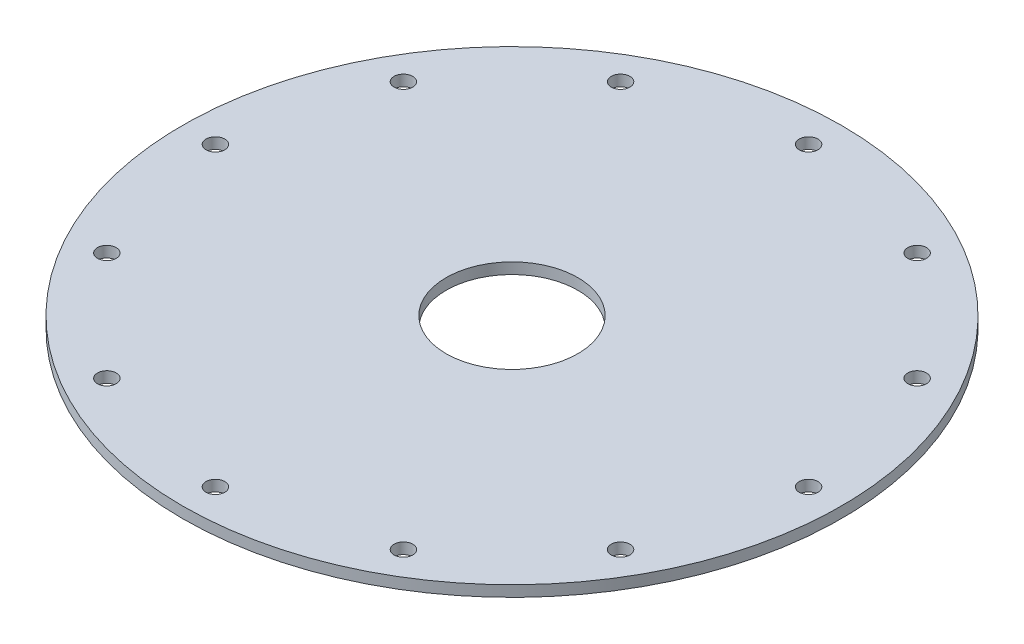
ISO-10303-21;
HEADER;
FILE_DESCRIPTION(('STEP AP214'),'2;1');
FILE_NAME('part.step','',(''),(''),'','','');
FILE_SCHEMA(('AUTOMOTIVE_DESIGN { 1 0 10303 214 1 1 1 1 }'));
ENDSEC;
DATA;
#1=APPLICATION_CONTEXT('core data for automotive mechanical design processes');
#2=APPLICATION_PROTOCOL_DEFINITION('international standard','automotive_design',2000,#1);
#3=PRODUCT_CONTEXT('',#1,'mechanical');
#4=PRODUCT('Part','Part','',(#3));
#5=PRODUCT_RELATED_PRODUCT_CATEGORY('part','',(#4));
#6=PRODUCT_DEFINITION_FORMATION('','',#4);
#7=PRODUCT_DEFINITION_CONTEXT('part definition',#1,'design');
#8=PRODUCT_DEFINITION('design','',#6,#7);
#9=PRODUCT_DEFINITION_SHAPE('','',#8);
#10=(LENGTH_UNIT() NAMED_UNIT(*) SI_UNIT(.MILLI.,.METRE.));
#11=(NAMED_UNIT(*) PLANE_ANGLE_UNIT() SI_UNIT($,.RADIAN.));
#12=(NAMED_UNIT(*) SI_UNIT($,.STERADIAN.) SOLID_ANGLE_UNIT());
#13=UNCERTAINTY_MEASURE_WITH_UNIT(LENGTH_MEASURE(1.E-05),#10,'distance_accuracy_value','');
#14=(GEOMETRIC_REPRESENTATION_CONTEXT(3) GLOBAL_UNCERTAINTY_ASSIGNED_CONTEXT((#13)) GLOBAL_UNIT_ASSIGNED_CONTEXT((#10,
#11,#12)) REPRESENTATION_CONTEXT('',''));
#15=CARTESIAN_POINT('',(0.,0.,0.));
#16=DIRECTION('',(0.,0.,1.));
#17=DIRECTION('',(1.,0.,0.));
#18=AXIS2_PLACEMENT_3D('',#15,#16,#17);
#19=CARTESIAN_POINT('',(-47.625,0.,0.));
#20=DIRECTION('',(0.,-1.,0.));
#21=DIRECTION('',(0.,0.,-1.));
#22=AXIS2_PLACEMENT_3D('',#19,#20,#21);
#23=PLANE('',#22);
#24=CARTESIAN_POINT('',(-21.4312500000004,0.,37.1200138697103));
#25=DIRECTION('',(0.,1.,0.));
#26=DIRECTION('',(0.,0.,1.));
#27=AXIS2_PLACEMENT_3D('',#24,#25,#26);
#28=CIRCLE('',#27,1.35255);
#29=CARTESIAN_POINT('',(-21.4312500000004,0.,38.4725638697103));
#30=VERTEX_POINT('',#29);
#31=EDGE_CURVE('E115',#30,#30,#28,.T.);
#32=ORIENTED_EDGE('',*,*,#31,.T.);
#33=EDGE_LOOP('',(#32));
#34=FACE_BOUND('',#33,.T.);
#35=CARTESIAN_POINT('',(21.4312499999997,0.,37.1200138697107));
#36=DIRECTION('',(0.,1.,0.));
#37=DIRECTION('',(0.,0.,1.));
#38=AXIS2_PLACEMENT_3D('',#35,#36,#37);
#39=CIRCLE('',#38,1.35255);
#40=CARTESIAN_POINT('',(21.4312499999997,0.,38.4725638697107));
#41=VERTEX_POINT('',#40);
#42=EDGE_CURVE('E103',#41,#41,#39,.T.);
#43=ORIENTED_EDGE('',*,*,#42,.T.);
#44=EDGE_LOOP('',(#43));
#45=FACE_BOUND('',#44,.T.);
#46=CARTESIAN_POINT('',(42.8625,0.,2.36953774157887E-13));
#47=DIRECTION('',(0.,1.,0.));
#48=DIRECTION('',(0.,0.,1.));
#49=AXIS2_PLACEMENT_3D('',#46,#47,#48);
#50=CIRCLE('',#49,1.35255);
#51=CARTESIAN_POINT('',(42.8625,0.,1.35255000000024));
#52=VERTEX_POINT('',#51);
#53=EDGE_CURVE('E91',#52,#52,#50,.T.);
#54=ORIENTED_EDGE('',*,*,#53,.T.);
#55=EDGE_LOOP('',(#54));
#56=FACE_BOUND('',#55,.T.);
#57=CARTESIAN_POINT('',(-21.4312499999999,0.,-37.1200138697105));
#58=DIRECTION('',(0.,1.,0.));
#59=DIRECTION('',(0.,0.,1.));
#60=AXIS2_PLACEMENT_3D('',#57,#58,#59);
#61=CIRCLE('',#60,1.35255);
#62=CARTESIAN_POINT('',(-21.4312499999999,0.,-35.7674638697105));
#63=VERTEX_POINT('',#62);
#64=EDGE_CURVE('E67',#63,#63,#61,.T.);
#65=ORIENTED_EDGE('',*,*,#64,.T.);
#66=EDGE_LOOP('',(#65));
#67=FACE_BOUND('',#66,.T.);
#68=CARTESIAN_POINT('',(-37.1200138697105,0.,-21.43125));
#69=DIRECTION('',(0.,1.,0.));
#70=DIRECTION('',(0.,0.,1.));
#71=AXIS2_PLACEMENT_3D('',#68,#69,#70);
#72=CIRCLE('',#71,1.35255);
#73=CARTESIAN_POINT('',(-37.1200138697105,0.,-20.0787));
#74=VERTEX_POINT('',#73);
#75=EDGE_CURVE('E61',#74,#74,#72,.T.);
#76=ORIENTED_EDGE('',*,*,#75,.T.);
#77=EDGE_LOOP('',(#76));
#78=FACE_BOUND('',#77,.T.);
#79=CARTESIAN_POINT('',(-42.8625,0.,0.));
#80=DIRECTION('',(0.,1.,0.));
#81=DIRECTION('',(0.,0.,1.));
#82=AXIS2_PLACEMENT_3D('',#79,#80,#81);
#83=CIRCLE('',#82,1.35255);
#84=CARTESIAN_POINT('',(-42.8625,0.,1.35255000000001));
#85=VERTEX_POINT('',#84);
#86=EDGE_CURVE('E55',#85,#85,#83,.T.);
#87=ORIENTED_EDGE('',*,*,#86,.T.);
#88=EDGE_LOOP('',(#87));
#89=FACE_BOUND('',#88,.T.);
#90=CARTESIAN_POINT('',(0.,0.,0.));
#91=DIRECTION('',(0.,1.,0.));
#92=DIRECTION('',(0.,0.,1.));
#93=AXIS2_PLACEMENT_3D('',#90,#91,#92);
#94=CIRCLE('',#93,9.525);
#95=CARTESIAN_POINT('',(0.,0.,9.525));
#96=VERTEX_POINT('',#95);
#97=EDGE_CURVE('E46',#96,#96,#94,.T.);
#98=ORIENTED_EDGE('',*,*,#97,.T.);
#99=EDGE_LOOP('',(#98));
#100=FACE_BOUND('',#99,.T.);
#101=CARTESIAN_POINT('',(0.,0.,0.));
#102=DIRECTION('',(0.,1.,0.));
#103=DIRECTION('',(0.,0.,1.));
#104=AXIS2_PLACEMENT_3D('',#101,#102,#103);
#105=CIRCLE('',#104,47.625);
#106=CARTESIAN_POINT('',(0.,0.,47.625));
#107=VERTEX_POINT('',#106);
#108=EDGE_CURVE('E50',#107,#107,#105,.T.);
#109=ORIENTED_EDGE('',*,*,#108,.F.);
#110=EDGE_LOOP('',(#109));
#111=FACE_BOUND('',#110,.T.);
#112=CARTESIAN_POINT('',(1.15852315907521E-13,0.,-42.8625));
#113=DIRECTION('',(0.,1.,0.));
#114=DIRECTION('',(0.,0.,1.));
#115=AXIS2_PLACEMENT_3D('',#112,#113,#114);
#116=CIRCLE('',#115,1.35255);
#117=CARTESIAN_POINT('',(1.15852315907521E-13,0.,-41.50995));
#118=VERTEX_POINT('',#117);
#119=EDGE_CURVE('E73',#118,#118,#116,.T.);
#120=ORIENTED_EDGE('',*,*,#119,.T.);
#121=EDGE_LOOP('',(#120));
#122=FACE_BOUND('',#121,.T.);
#123=CARTESIAN_POINT('',(21.4312500000001,0.,-37.1200138697104));
#124=DIRECTION('',(0.,1.,0.));
#125=DIRECTION('',(0.,0.,1.));
#126=AXIS2_PLACEMENT_3D('',#123,#124,#125);
#127=CIRCLE('',#126,1.35255);
#128=CARTESIAN_POINT('',(21.4312500000001,0.,-35.7674638697104));
#129=VERTEX_POINT('',#128);
#130=EDGE_CURVE('E79',#129,#129,#127,.T.);
#131=ORIENTED_EDGE('',*,*,#130,.T.);
#132=EDGE_LOOP('',(#131));
#133=FACE_BOUND('',#132,.T.);
#134=CARTESIAN_POINT('',(37.1200138697106,0.,-21.4312499999998));
#135=DIRECTION('',(0.,1.,0.));
#136=DIRECTION('',(0.,0.,1.));
#137=AXIS2_PLACEMENT_3D('',#134,#135,#136);
#138=CIRCLE('',#137,1.35255);
#139=CARTESIAN_POINT('',(37.1200138697106,0.,-20.0786999999998));
#140=VERTEX_POINT('',#139);
#141=EDGE_CURVE('E85',#140,#140,#138,.T.);
#142=ORIENTED_EDGE('',*,*,#141,.T.);
#143=EDGE_LOOP('',(#142));
#144=FACE_BOUND('',#143,.T.);
#145=CARTESIAN_POINT('',(37.1200138697104,0.,21.4312500000002));
#146=DIRECTION('',(0.,1.,0.));
#147=DIRECTION('',(0.,0.,1.));
#148=AXIS2_PLACEMENT_3D('',#145,#146,#147);
#149=CIRCLE('',#148,1.35255);
#150=CARTESIAN_POINT('',(37.1200138697104,0.,22.7838000000002));
#151=VERTEX_POINT('',#150);
#152=EDGE_CURVE('E97',#151,#151,#149,.T.);
#153=ORIENTED_EDGE('',*,*,#152,.T.);
#154=EDGE_LOOP('',(#153));
#155=FACE_BOUND('',#154,.T.);
#156=CARTESIAN_POINT('',(-3.67572619286853E-13,0.,42.8625));
#157=DIRECTION('',(0.,1.,0.));
#158=DIRECTION('',(0.,0.,1.));
#159=AXIS2_PLACEMENT_3D('',#156,#157,#158);
#160=CIRCLE('',#159,1.35255);
#161=CARTESIAN_POINT('',(-3.67572619286853E-13,0.,44.21505));
#162=VERTEX_POINT('',#161);
#163=EDGE_CURVE('E109',#162,#162,#160,.T.);
#164=ORIENTED_EDGE('',*,*,#163,.T.);
#165=EDGE_LOOP('',(#164));
#166=FACE_BOUND('',#165,.T.);
#167=CARTESIAN_POINT('',(-37.1200138697107,0.,21.4312499999996));
#168=DIRECTION('',(0.,1.,0.));
#169=DIRECTION('',(0.,0.,1.));
#170=AXIS2_PLACEMENT_3D('',#167,#168,#169);
#171=CIRCLE('',#170,1.35255);
#172=CARTESIAN_POINT('',(-37.1200138697107,0.,22.7837999999996));
#173=VERTEX_POINT('',#172);
#174=EDGE_CURVE('E121',#173,#173,#171,.T.);
#175=ORIENTED_EDGE('',*,*,#174,.T.);
#176=EDGE_LOOP('',(#175));
#177=FACE_BOUND('',#176,.T.);
#178=ADVANCED_FACE('F35',(#34,#45,#56,#67,#78,#89,#100,#111,#122,#133,#144,#155,#166,#177),#23,.T.);
#179=CARTESIAN_POINT('',(0.,55.,0.));
#180=DIRECTION('',(0.,1.,0.));
#181=DIRECTION('',(0.,0.,1.));
#182=AXIS2_PLACEMENT_3D('',#179,#180,#181);
#183=CYLINDRICAL_SURFACE('',#182,47.625);
#184=ORIENTED_EDGE('',*,*,#108,.T.);
#185=EDGE_LOOP('',(#184));
#186=FACE_BOUND('',#185,.T.);
#187=CARTESIAN_POINT('',(0.,1.5875,0.));
#188=DIRECTION('',(0.,1.,0.));
#189=DIRECTION('',(0.,0.,1.));
#190=AXIS2_PLACEMENT_3D('',#187,#188,#189);
#191=CIRCLE('',#190,47.625);
#192=CARTESIAN_POINT('',(0.,1.5875,47.625));
#193=VERTEX_POINT('',#192);
#194=EDGE_CURVE('E10',#193,#193,#191,.T.);
#195=ORIENTED_EDGE('',*,*,#194,.F.);
#196=EDGE_LOOP('',(#195));
#197=FACE_BOUND('',#196,.T.);
#198=ADVANCED_FACE('F37',(#186,#197),#183,.T.);
#199=CARTESIAN_POINT('',(-47.625,1.5875,0.));
#200=DIRECTION('',(0.,1.,0.));
#201=DIRECTION('',(0.,0.,1.));
#202=AXIS2_PLACEMENT_3D('',#199,#200,#201);
#203=PLANE('',#202);
#204=CARTESIAN_POINT('',(-37.1200138697107,1.5875,21.4312499999996));
#205=DIRECTION('',(0.,1.,0.));
#206=DIRECTION('',(0.,0.,1.));
#207=AXIS2_PLACEMENT_3D('',#204,#205,#206);
#208=CIRCLE('',#207,1.35255);
#209=CARTESIAN_POINT('',(-37.1200138697107,1.5875,22.7837999999996));
#210=VERTEX_POINT('',#209);
#211=EDGE_CURVE('E124',#210,#210,#208,.T.);
#212=ORIENTED_EDGE('',*,*,#211,.F.);
#213=EDGE_LOOP('',(#212));
#214=FACE_BOUND('',#213,.T.);
#215=CARTESIAN_POINT('',(-21.4312500000004,1.5875,37.1200138697103));
#216=DIRECTION('',(0.,1.,0.));
#217=DIRECTION('',(0.,0.,1.));
#218=AXIS2_PLACEMENT_3D('',#215,#216,#217);
#219=CIRCLE('',#218,1.35255);
#220=CARTESIAN_POINT('',(-21.4312500000004,1.5875,38.4725638697103));
#221=VERTEX_POINT('',#220);
#222=EDGE_CURVE('E118',#221,#221,#219,.T.);
#223=ORIENTED_EDGE('',*,*,#222,.F.);
#224=EDGE_LOOP('',(#223));
#225=FACE_BOUND('',#224,.T.);
#226=CARTESIAN_POINT('',(-3.67572619286853E-13,1.5875,42.8625));
#227=DIRECTION('',(0.,1.,0.));
#228=DIRECTION('',(0.,0.,1.));
#229=AXIS2_PLACEMENT_3D('',#226,#227,#228);
#230=CIRCLE('',#229,1.35255);
#231=CARTESIAN_POINT('',(-3.67572619286853E-13,1.5875,44.21505));
#232=VERTEX_POINT('',#231);
#233=EDGE_CURVE('E112',#232,#232,#230,.T.);
#234=ORIENTED_EDGE('',*,*,#233,.F.);
#235=EDGE_LOOP('',(#234));
#236=FACE_BOUND('',#235,.T.);
#237=CARTESIAN_POINT('',(21.4312499999997,1.5875,37.1200138697107));
#238=DIRECTION('',(0.,1.,0.));
#239=DIRECTION('',(0.,0.,1.));
#240=AXIS2_PLACEMENT_3D('',#237,#238,#239);
#241=CIRCLE('',#240,1.35255);
#242=CARTESIAN_POINT('',(21.4312499999997,1.5875,38.4725638697107));
#243=VERTEX_POINT('',#242);
#244=EDGE_CURVE('E106',#243,#243,#241,.T.);
#245=ORIENTED_EDGE('',*,*,#244,.F.);
#246=EDGE_LOOP('',(#245));
#247=FACE_BOUND('',#246,.T.);
#248=CARTESIAN_POINT('',(37.1200138697104,1.5875,21.4312500000002));
#249=DIRECTION('',(0.,1.,0.));
#250=DIRECTION('',(0.,0.,1.));
#251=AXIS2_PLACEMENT_3D('',#248,#249,#250);
#252=CIRCLE('',#251,1.35255);
#253=CARTESIAN_POINT('',(37.1200138697104,1.5875,22.7838000000002));
#254=VERTEX_POINT('',#253);
#255=EDGE_CURVE('E100',#254,#254,#252,.T.);
#256=ORIENTED_EDGE('',*,*,#255,.F.);
#257=EDGE_LOOP('',(#256));
#258=FACE_BOUND('',#257,.T.);
#259=CARTESIAN_POINT('',(42.8625,1.5875,2.36953774157887E-13));
#260=DIRECTION('',(0.,1.,0.));
#261=DIRECTION('',(0.,0.,1.));
#262=AXIS2_PLACEMENT_3D('',#259,#260,#261);
#263=CIRCLE('',#262,1.35255);
#264=CARTESIAN_POINT('',(42.8625,1.5875,1.35255000000024));
#265=VERTEX_POINT('',#264);
#266=EDGE_CURVE('E94',#265,#265,#263,.T.);
#267=ORIENTED_EDGE('',*,*,#266,.F.);
#268=EDGE_LOOP('',(#267));
#269=FACE_BOUND('',#268,.T.);
#270=CARTESIAN_POINT('',(37.1200138697106,1.5875,-21.4312499999998));
#271=DIRECTION('',(0.,1.,0.));
#272=DIRECTION('',(0.,0.,1.));
#273=AXIS2_PLACEMENT_3D('',#270,#271,#272);
#274=CIRCLE('',#273,1.35255);
#275=CARTESIAN_POINT('',(37.1200138697106,1.5875,-20.0786999999998));
#276=VERTEX_POINT('',#275);
#277=EDGE_CURVE('E88',#276,#276,#274,.T.);
#278=ORIENTED_EDGE('',*,*,#277,.F.);
#279=EDGE_LOOP('',(#278));
#280=FACE_BOUND('',#279,.T.);
#281=CARTESIAN_POINT('',(21.4312500000001,1.5875,-37.1200138697104));
#282=DIRECTION('',(0.,1.,0.));
#283=DIRECTION('',(0.,0.,1.));
#284=AXIS2_PLACEMENT_3D('',#281,#282,#283);
#285=CIRCLE('',#284,1.35255);
#286=CARTESIAN_POINT('',(21.4312500000001,1.5875,-35.7674638697104));
#287=VERTEX_POINT('',#286);
#288=EDGE_CURVE('E82',#287,#287,#285,.T.);
#289=ORIENTED_EDGE('',*,*,#288,.F.);
#290=EDGE_LOOP('',(#289));
#291=FACE_BOUND('',#290,.T.);
#292=CARTESIAN_POINT('',(1.15852315907521E-13,1.5875,-42.8625));
#293=DIRECTION('',(0.,1.,0.));
#294=DIRECTION('',(0.,0.,1.));
#295=AXIS2_PLACEMENT_3D('',#292,#293,#294);
#296=CIRCLE('',#295,1.35255);
#297=CARTESIAN_POINT('',(1.15852315907521E-13,1.5875,-41.50995));
#298=VERTEX_POINT('',#297);
#299=EDGE_CURVE('E76',#298,#298,#296,.T.);
#300=ORIENTED_EDGE('',*,*,#299,.F.);
#301=EDGE_LOOP('',(#300));
#302=FACE_BOUND('',#301,.T.);
#303=CARTESIAN_POINT('',(-21.4312499999999,1.5875,-37.1200138697105));
#304=DIRECTION('',(0.,1.,0.));
#305=DIRECTION('',(0.,0.,1.));
#306=AXIS2_PLACEMENT_3D('',#303,#304,#305);
#307=CIRCLE('',#306,1.35255);
#308=CARTESIAN_POINT('',(-21.4312499999999,1.5875,-35.7674638697105));
#309=VERTEX_POINT('',#308);
#310=EDGE_CURVE('E70',#309,#309,#307,.T.);
#311=ORIENTED_EDGE('',*,*,#310,.F.);
#312=EDGE_LOOP('',(#311));
#313=FACE_BOUND('',#312,.T.);
#314=CARTESIAN_POINT('',(-37.1200138697105,1.5875,-21.43125));
#315=DIRECTION('',(0.,1.,0.));
#316=DIRECTION('',(0.,0.,1.));
#317=AXIS2_PLACEMENT_3D('',#314,#315,#316);
#318=CIRCLE('',#317,1.35255);
#319=CARTESIAN_POINT('',(-37.1200138697105,1.5875,-20.0787));
#320=VERTEX_POINT('',#319);
#321=EDGE_CURVE('E64',#320,#320,#318,.T.);
#322=ORIENTED_EDGE('',*,*,#321,.F.);
#323=EDGE_LOOP('',(#322));
#324=FACE_BOUND('',#323,.T.);
#325=CARTESIAN_POINT('',(-42.8625,1.5875,0.));
#326=DIRECTION('',(0.,1.,0.));
#327=DIRECTION('',(0.,0.,1.));
#328=AXIS2_PLACEMENT_3D('',#325,#326,#327);
#329=CIRCLE('',#328,1.35255);
#330=CARTESIAN_POINT('',(-42.8625,1.5875,1.35255000000001));
#331=VERTEX_POINT('',#330);
#332=EDGE_CURVE('E58',#331,#331,#329,.T.);
#333=ORIENTED_EDGE('',*,*,#332,.F.);
#334=EDGE_LOOP('',(#333));
#335=FACE_BOUND('',#334,.T.);
#336=ORIENTED_EDGE('',*,*,#194,.T.);
#337=EDGE_LOOP('',(#336));
#338=FACE_BOUND('',#337,.T.);
#339=CARTESIAN_POINT('',(0.,1.5875,0.));
#340=DIRECTION('',(0.,1.,0.));
#341=DIRECTION('',(0.,0.,1.));
#342=AXIS2_PLACEMENT_3D('',#339,#340,#341);
#343=CIRCLE('',#342,9.525);
#344=CARTESIAN_POINT('',(0.,1.5875,9.525));
#345=VERTEX_POINT('',#344);
#346=EDGE_CURVE('E42',#345,#345,#343,.T.);
#347=ORIENTED_EDGE('',*,*,#346,.F.);
#348=EDGE_LOOP('',(#347));
#349=FACE_BOUND('',#348,.T.);
#350=ADVANCED_FACE('F130',(#214,#225,#236,#247,#258,#269,#280,#291,#302,#313,#324,#335,#338,
#349),#203,.T.);
#351=CARTESIAN_POINT('',(0.,55.,0.));
#352=DIRECTION('',(0.,1.,0.));
#353=DIRECTION('',(0.,0.,1.));
#354=AXIS2_PLACEMENT_3D('',#351,#352,#353);
#355=CYLINDRICAL_SURFACE('',#354,9.525);
#356=ORIENTED_EDGE('',*,*,#346,.T.);
#357=EDGE_LOOP('',(#356));
#358=FACE_BOUND('',#357,.T.);
#359=ORIENTED_EDGE('',*,*,#97,.F.);
#360=EDGE_LOOP('',(#359));
#361=FACE_BOUND('',#360,.T.);
#362=ADVANCED_FACE('F133',(#358,#361),#355,.F.);
#363=CARTESIAN_POINT('',(-42.8625,1.5875,0.));
#364=DIRECTION('',(0.,1.,0.));
#365=DIRECTION('',(0.,0.,1.));
#366=AXIS2_PLACEMENT_3D('',#363,#364,#365);
#367=CYLINDRICAL_SURFACE('',#366,1.35255);
#368=ORIENTED_EDGE('',*,*,#86,.F.);
#369=EDGE_LOOP('',(#368));
#370=FACE_BOUND('',#369,.T.);
#371=ORIENTED_EDGE('',*,*,#332,.T.);
#372=EDGE_LOOP('',(#371));
#373=FACE_BOUND('',#372,.T.);
#374=ADVANCED_FACE('F157',(#370,#373),#367,.F.);
#375=CARTESIAN_POINT('',(-37.1200138697105,1.5875,-21.43125));
#376=DIRECTION('',(0.,1.,0.));
#377=DIRECTION('',(0.,0.,1.));
#378=AXIS2_PLACEMENT_3D('',#375,#376,#377);
#379=CYLINDRICAL_SURFACE('',#378,1.35255);
#380=ORIENTED_EDGE('',*,*,#75,.F.);
#381=EDGE_LOOP('',(#380));
#382=FACE_BOUND('',#381,.T.);
#383=ORIENTED_EDGE('',*,*,#321,.T.);
#384=EDGE_LOOP('',(#383));
#385=FACE_BOUND('',#384,.T.);
#386=ADVANCED_FACE('F159',(#382,#385),#379,.F.);
#387=CARTESIAN_POINT('',(-21.4312499999999,1.5875,-37.1200138697105));
#388=DIRECTION('',(0.,1.,0.));
#389=DIRECTION('',(0.,0.,1.));
#390=AXIS2_PLACEMENT_3D('',#387,#388,#389);
#391=CYLINDRICAL_SURFACE('',#390,1.35255);
#392=ORIENTED_EDGE('',*,*,#64,.F.);
#393=EDGE_LOOP('',(#392));
#394=FACE_BOUND('',#393,.T.);
#395=ORIENTED_EDGE('',*,*,#310,.T.);
#396=EDGE_LOOP('',(#395));
#397=FACE_BOUND('',#396,.T.);
#398=ADVANCED_FACE('F166',(#394,#397),#391,.F.);
#399=CARTESIAN_POINT('',(1.15852315907521E-13,1.5875,-42.8625));
#400=DIRECTION('',(0.,1.,0.));
#401=DIRECTION('',(0.,0.,1.));
#402=AXIS2_PLACEMENT_3D('',#399,#400,#401);
#403=CYLINDRICAL_SURFACE('',#402,1.35255);
#404=ORIENTED_EDGE('',*,*,#119,.F.);
#405=EDGE_LOOP('',(#404));
#406=FACE_BOUND('',#405,.T.);
#407=ORIENTED_EDGE('',*,*,#299,.T.);
#408=EDGE_LOOP('',(#407));
#409=FACE_BOUND('',#408,.T.);
#410=ADVANCED_FACE('F237',(#406,#409),#403,.F.);
#411=CARTESIAN_POINT('',(21.4312500000001,1.5875,-37.1200138697104));
#412=DIRECTION('',(0.,1.,0.));
#413=DIRECTION('',(0.,0.,1.));
#414=AXIS2_PLACEMENT_3D('',#411,#412,#413);
#415=CYLINDRICAL_SURFACE('',#414,1.35255);
#416=ORIENTED_EDGE('',*,*,#130,.F.);
#417=EDGE_LOOP('',(#416));
#418=FACE_BOUND('',#417,.T.);
#419=ORIENTED_EDGE('',*,*,#288,.T.);
#420=EDGE_LOOP('',(#419));
#421=FACE_BOUND('',#420,.T.);
#422=ADVANCED_FACE('F233',(#418,#421),#415,.F.);
#423=CARTESIAN_POINT('',(37.1200138697106,1.5875,-21.4312499999998));
#424=DIRECTION('',(0.,1.,0.));
#425=DIRECTION('',(0.,0.,1.));
#426=AXIS2_PLACEMENT_3D('',#423,#424,#425);
#427=CYLINDRICAL_SURFACE('',#426,1.35255);
#428=ORIENTED_EDGE('',*,*,#141,.F.);
#429=EDGE_LOOP('',(#428));
#430=FACE_BOUND('',#429,.T.);
#431=ORIENTED_EDGE('',*,*,#277,.T.);
#432=EDGE_LOOP('',(#431));
#433=FACE_BOUND('',#432,.T.);
#434=ADVANCED_FACE('F229',(#430,#433),#427,.F.);
#435=CARTESIAN_POINT('',(42.8625,1.5875,2.36953774157887E-13));
#436=DIRECTION('',(0.,1.,0.));
#437=DIRECTION('',(0.,0.,1.));
#438=AXIS2_PLACEMENT_3D('',#435,#436,#437);
#439=CYLINDRICAL_SURFACE('',#438,1.35255);
#440=ORIENTED_EDGE('',*,*,#53,.F.);
#441=EDGE_LOOP('',(#440));
#442=FACE_BOUND('',#441,.T.);
#443=ORIENTED_EDGE('',*,*,#266,.T.);
#444=EDGE_LOOP('',(#443));
#445=FACE_BOUND('',#444,.T.);
#446=ADVANCED_FACE('F225',(#442,#445),#439,.F.);
#447=CARTESIAN_POINT('',(37.1200138697104,1.5875,21.4312500000002));
#448=DIRECTION('',(0.,1.,0.));
#449=DIRECTION('',(0.,0.,1.));
#450=AXIS2_PLACEMENT_3D('',#447,#448,#449);
#451=CYLINDRICAL_SURFACE('',#450,1.35255);
#452=ORIENTED_EDGE('',*,*,#152,.F.);
#453=EDGE_LOOP('',(#452));
#454=FACE_BOUND('',#453,.T.);
#455=ORIENTED_EDGE('',*,*,#255,.T.);
#456=EDGE_LOOP('',(#455));
#457=FACE_BOUND('',#456,.T.);
#458=ADVANCED_FACE('F221',(#454,#457),#451,.F.);
#459=CARTESIAN_POINT('',(21.4312499999997,1.5875,37.1200138697107));
#460=DIRECTION('',(0.,1.,0.));
#461=DIRECTION('',(0.,0.,1.));
#462=AXIS2_PLACEMENT_3D('',#459,#460,#461);
#463=CYLINDRICAL_SURFACE('',#462,1.35255);
#464=ORIENTED_EDGE('',*,*,#42,.F.);
#465=EDGE_LOOP('',(#464));
#466=FACE_BOUND('',#465,.T.);
#467=ORIENTED_EDGE('',*,*,#244,.T.);
#468=EDGE_LOOP('',(#467));
#469=FACE_BOUND('',#468,.T.);
#470=ADVANCED_FACE('F217',(#466,#469),#463,.F.);
#471=CARTESIAN_POINT('',(-3.67572619286853E-13,1.5875,42.8625));
#472=DIRECTION('',(0.,1.,0.));
#473=DIRECTION('',(0.,0.,1.));
#474=AXIS2_PLACEMENT_3D('',#471,#472,#473);
#475=CYLINDRICAL_SURFACE('',#474,1.35255);
#476=ORIENTED_EDGE('',*,*,#163,.F.);
#477=EDGE_LOOP('',(#476));
#478=FACE_BOUND('',#477,.T.);
#479=ORIENTED_EDGE('',*,*,#233,.T.);
#480=EDGE_LOOP('',(#479));
#481=FACE_BOUND('',#480,.T.);
#482=ADVANCED_FACE('F211',(#478,#481),#475,.F.);
#483=CARTESIAN_POINT('',(-21.4312500000004,1.5875,37.1200138697103));
#484=DIRECTION('',(0.,1.,0.));
#485=DIRECTION('',(0.,0.,1.));
#486=AXIS2_PLACEMENT_3D('',#483,#484,#485);
#487=CYLINDRICAL_SURFACE('',#486,1.35255);
#488=ORIENTED_EDGE('',*,*,#31,.F.);
#489=EDGE_LOOP('',(#488));
#490=FACE_BOUND('',#489,.T.);
#491=ORIENTED_EDGE('',*,*,#222,.T.);
#492=EDGE_LOOP('',(#491));
#493=FACE_BOUND('',#492,.T.);
#494=ADVANCED_FACE('F206',(#490,#493),#487,.F.);
#495=CARTESIAN_POINT('',(-37.1200138697107,1.5875,21.4312499999996));
#496=DIRECTION('',(0.,1.,0.));
#497=DIRECTION('',(0.,0.,1.));
#498=AXIS2_PLACEMENT_3D('',#495,#496,#497);
#499=CYLINDRICAL_SURFACE('',#498,1.35255);
#500=ORIENTED_EDGE('',*,*,#174,.F.);
#501=EDGE_LOOP('',(#500));
#502=FACE_BOUND('',#501,.T.);
#503=ORIENTED_EDGE('',*,*,#211,.T.);
#504=EDGE_LOOP('',(#503));
#505=FACE_BOUND('',#504,.T.);
#506=ADVANCED_FACE('F128',(#502,#505),#499,.F.);
#507=CLOSED_SHELL('',(#178,#198,#350,#362,#374,#386,#398,#410,#422,#434,#446,#458,#470,#482,
#494,#506));
#508=MANIFOLD_SOLID_BREP('B2',#507);
#509=ADVANCED_BREP_SHAPE_REPRESENTATION('',(#18,#508),#14);
#510=SHAPE_DEFINITION_REPRESENTATION(#9,#509);
ENDSEC;
END-ISO-10303-21;
